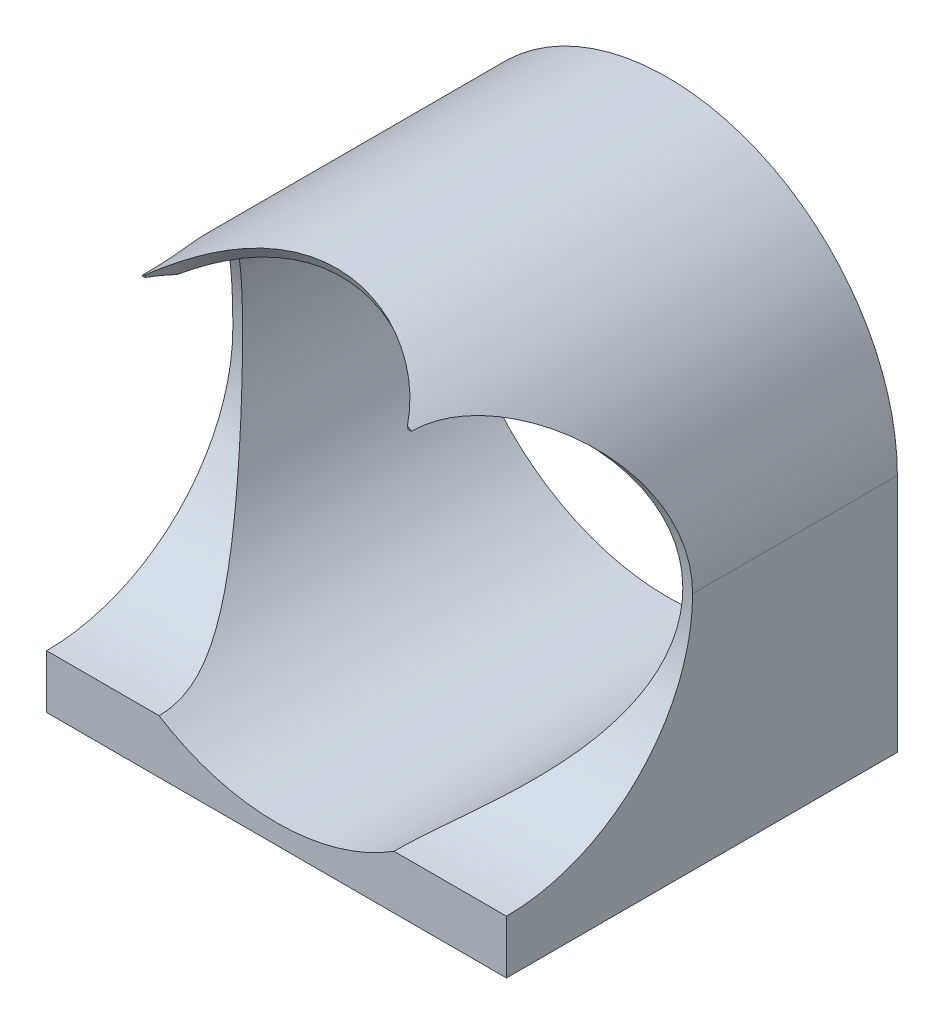
ISO-10303-21;
HEADER;
FILE_DESCRIPTION(('STEP AP214'),'2;1');
FILE_NAME('part.step','',(''),(''),'','','');
FILE_SCHEMA(('AUTOMOTIVE_DESIGN { 1 0 10303 214 1 1 1 1 }'));
ENDSEC;
DATA;
#1=APPLICATION_CONTEXT('core data for automotive mechanical design processes');
#2=APPLICATION_PROTOCOL_DEFINITION('international standard','automotive_design',2000,#1);
#3=PRODUCT_CONTEXT('',#1,'mechanical');
#4=PRODUCT('Part','Part','',(#3));
#5=PRODUCT_RELATED_PRODUCT_CATEGORY('part','',(#4));
#6=PRODUCT_DEFINITION_FORMATION('','',#4);
#7=PRODUCT_DEFINITION_CONTEXT('part definition',#1,'design');
#8=PRODUCT_DEFINITION('design','',#6,#7);
#9=PRODUCT_DEFINITION_SHAPE('','',#8);
#10=(LENGTH_UNIT() NAMED_UNIT(*) SI_UNIT(.MILLI.,.METRE.));
#11=(NAMED_UNIT(*) PLANE_ANGLE_UNIT() SI_UNIT($,.RADIAN.));
#12=(NAMED_UNIT(*) SI_UNIT($,.STERADIAN.) SOLID_ANGLE_UNIT());
#13=UNCERTAINTY_MEASURE_WITH_UNIT(LENGTH_MEASURE(1.E-05),#10,'distance_accuracy_value','');
#14=(GEOMETRIC_REPRESENTATION_CONTEXT(3) GLOBAL_UNCERTAINTY_ASSIGNED_CONTEXT((#13)) GLOBAL_UNIT_ASSIGNED_CONTEXT((#10,
#11,#12)) REPRESENTATION_CONTEXT('',''));
#15=CARTESIAN_POINT('',(0.,0.,0.));
#16=DIRECTION('',(0.,0.,1.));
#17=DIRECTION('',(1.,0.,0.));
#18=AXIS2_PLACEMENT_3D('',#15,#16,#17);
#19=CARTESIAN_POINT('',(0.,0.,0.));
#20=DIRECTION('',(0.,0.,1.));
#21=DIRECTION('',(1.,0.,0.));
#22=AXIS2_PLACEMENT_3D('',#19,#20,#21);
#23=PLANE('',#22);
#24=CARTESIAN_POINT('',(0.,-2.56739074444567E-13,0.));
#25=DIRECTION('',(0.,0.,1.));
#26=DIRECTION('',(0.,-1.,0.));
#27=AXIS2_PLACEMENT_3D('',#24,#25,#26);
#28=ELLIPSE('',#27,36.1565767183721,15.85);
#29=CARTESIAN_POINT('',(13.4715921210035,19.05,0.));
#30=VERTEX_POINT('',#29);
#31=CARTESIAN_POINT('',(13.3915454843399,19.3414615409709,0.));
#32=VERTEX_POINT('',#31);
#33=EDGE_CURVE('E120',#30,#32,#28,.T.);
#34=ORIENTED_EDGE('',*,*,#33,.F.);
#35=DIRECTION('',(1.,0.,0.));
#36=VECTOR('',#35,1.);
#37=CARTESIAN_POINT('',(-23.525,19.05,0.));
#38=LINE('',#37,#36);
#39=CARTESIAN_POINT('',(13.8030114467822,19.05,0.));
#40=VERTEX_POINT('',#39);
#41=EDGE_CURVE('E127',#40,#30,#38,.F.);
#42=ORIENTED_EDGE('',*,*,#41,.F.);
#43=CARTESIAN_POINT('',(0.,0.,0.));
#44=DIRECTION('',(0.,0.,1.));
#45=DIRECTION('',(1.,0.,0.));
#46=AXIS2_PLACEMENT_3D('',#43,#44,#45);
#47=CIRCLE('',#46,23.525);
#48=EDGE_CURVE('E129',#40,#32,#47,.T.);
#49=ORIENTED_EDGE('',*,*,#48,.T.);
#50=EDGE_LOOP('',(#34,#42,#49));
#51=FACE_BOUND('',#50,.T.);
#52=ADVANCED_FACE('F38',(#51),#23,.T.);
#53=DIRECTION('',(1.,0.,0.));
#54=VECTOR('',#53,1.);
#55=CARTESIAN_POINT('',(-23.525,-19.05,0.));
#56=LINE('',#55,#54);
#57=CARTESIAN_POINT('',(-23.525,-19.05,0.));
#58=VERTEX_POINT('',#57);
#59=CARTESIAN_POINT('',(-12.0196973755581,-19.05,0.));
#60=VERTEX_POINT('',#59);
#61=EDGE_CURVE('E143',#58,#60,#56,.T.);
#62=ORIENTED_EDGE('',*,*,#61,.F.);
#63=DIRECTION('',(0.,-1.,0.));
#64=VECTOR('',#63,1.);
#65=CARTESIAN_POINT('',(-23.525,0.,0.));
#66=LINE('',#65,#64);
#67=CARTESIAN_POINT('',(-23.525,-24.525,0.));
#68=VERTEX_POINT('',#67);
#69=EDGE_CURVE('E218',#58,#68,#66,.T.);
#70=ORIENTED_EDGE('',*,*,#69,.T.);
#71=DIRECTION('',(-1.,0.,0.));
#72=VECTOR('',#71,1.);
#73=CARTESIAN_POINT('',(0.,-24.525,0.));
#74=LINE('',#73,#72);
#75=CARTESIAN_POINT('',(23.525,-24.525,0.));
#76=VERTEX_POINT('',#75);
#77=EDGE_CURVE('E214',#76,#68,#74,.T.);
#78=ORIENTED_EDGE('',*,*,#77,.F.);
#79=DIRECTION('',(0.,1.,0.));
#80=VECTOR('',#79,1.);
#81=CARTESIAN_POINT('',(23.525,0.,0.));
#82=LINE('',#81,#80);
#83=CARTESIAN_POINT('',(23.525,-19.05,0.));
#84=VERTEX_POINT('',#83);
#85=EDGE_CURVE('E212',#76,#84,#82,.T.);
#86=ORIENTED_EDGE('',*,*,#85,.T.);
#87=CARTESIAN_POINT('',(12.0196973755581,-19.05,0.));
#88=VERTEX_POINT('',#87);
#89=EDGE_CURVE('E67',#88,#84,#56,.T.);
#90=ORIENTED_EDGE('',*,*,#89,.F.);
#91=CARTESIAN_POINT('',(0.,0.,0.));
#92=DIRECTION('',(0.,0.,1.));
#93=DIRECTION('',(1.,0.,0.));
#94=AXIS2_PLACEMENT_3D('',#91,#92,#93);
#95=CIRCLE('',#94,22.525);
#96=EDGE_CURVE('E230',#60,#88,#95,.T.);
#97=ORIENTED_EDGE('',*,*,#96,.F.);
#98=EDGE_LOOP('',(#62,#70,#78,#86,#90,#97));
#99=FACE_BOUND('',#98,.T.);
#100=ADVANCED_FACE('F262',(#99),#23,.T.);
#101=CARTESIAN_POINT('',(0.,0.,-40.));
#102=DIRECTION('',(0.,0.,1.));
#103=DIRECTION('',(1.,0.,0.));
#104=AXIS2_PLACEMENT_3D('',#101,#102,#103);
#105=CYLINDRICAL_SURFACE('',#104,23.525);
#106=CARTESIAN_POINT('',(13.3915454843399,19.3414615409709,0.));
#107=CARTESIAN_POINT('',(13.2741452215655,19.4227488667331,-0.166660695032087));
#108=CARTESIAN_POINT('',(13.1529120521341,19.5051033609422,-0.33004845359528));
#109=CARTESIAN_POINT('',(12.9030253770353,19.67130056655,-0.650219697078125));
#110=CARTESIAN_POINT('',(12.7743729310915,19.755143064233,-0.807004119669323));
#111=CARTESIAN_POINT('',(12.3778314275055,20.0078233890627,-1.26716948233464));
#112=CARTESIAN_POINT('',(12.0991546014151,20.1779566607628,-1.56065052760486));
#113=CARTESIAN_POINT('',(11.515768045907,20.5164892557352,-2.12031969014437));
#114=CARTESIAN_POINT('',(11.2110985192502,20.6848908210303,-2.3865486036965));
#115=CARTESIAN_POINT('',(10.5773645559341,21.0160129679722,-2.89227573073942));
#116=CARTESIAN_POINT('',(10.2482961414954,21.1787326169006,-3.13176956956217));
#117=CARTESIAN_POINT('',(9.56856001999574,21.4943820139895,-3.58351081944035));
#118=CARTESIAN_POINT('',(9.21793309313228,21.6473291937976,-3.79580746455374));
#119=CARTESIAN_POINT('',(8.49669425673176,21.9404498027971,-4.19357950022337));
#120=CARTESIAN_POINT('',(8.12608232388604,22.0806232170898,-4.37905485949679));
#121=CARTESIAN_POINT('',(7.36710561874806,22.345310958521,-4.72302398974049));
#122=CARTESIAN_POINT('',(6.97873883354625,22.469823504117,-4.88151469172559));
#123=CARTESIAN_POINT('',(6.18671859679126,22.7006672022082,-5.17123872972058));
#124=CARTESIAN_POINT('',(5.78306480741167,22.8069979526184,-5.30247146294249));
#125=CARTESIAN_POINT('',(4.95199123258167,23.0019662382463,-5.54055919118524));
#126=CARTESIAN_POINT('',(4.52422394287642,23.0900475085813,-5.64665893177224));
#127=CARTESIAN_POINT('',(3.65836240062984,23.2429621144849,-5.82946793433219));
#128=CARTESIAN_POINT('',(3.22026795998736,23.3077950262533,-5.90617666053056));
#129=CARTESIAN_POINT('',(2.33701040273976,23.4128551963083,-6.02992232800186));
#130=CARTESIAN_POINT('',(1.89184764354196,23.4530836946701,-6.07696076467639));
#131=CARTESIAN_POINT('',(0.997817026609435,23.508095358831,-6.1411812655202));
#132=CARTESIAN_POINT('',(0.548949280828574,23.5228792906826,-6.15836422854016));
#133=CARTESIAN_POINT('',(-0.335337255626572,23.5266377724987,-6.16273704291516));
#134=CARTESIAN_POINT('',(-0.770748762106412,23.5163856094176,-6.15082552954681));
#135=CARTESIAN_POINT('',(-1.63865333593245,23.4718818786517,-6.09892373783703));
#136=CARTESIAN_POINT('',(-2.07114646423189,23.4376308137841,-6.05893404778038));
#137=CARTESIAN_POINT('',(-2.93007213570488,23.3458097664723,-5.95103598118804));
#138=CARTESIAN_POINT('',(-3.35650539962886,23.2882425816485,-5.8831309541021));
#139=CARTESIAN_POINT('',(-4.20039520760996,23.1509192670805,-5.71963837738186));
#140=CARTESIAN_POINT('',(-4.61785164092144,23.0711628637607,-5.62405048643902));
#141=CARTESIAN_POINT('',(-5.4397616161067,22.8912883007565,-5.40579942141535));
#142=CARTESIAN_POINT('',(-5.84424960662435,22.7912303555177,-5.28321622577943));
#143=CARTESIAN_POINT('',(-6.63887696615571,22.5725663436982,-5.0111122889143));
#144=CARTESIAN_POINT('',(-7.02901664637207,22.4539606796951,-4.86159213234027));
#145=CARTESIAN_POINT('',(-7.79259441119966,22.2005166508095,-4.53584619804188));
#146=CARTESIAN_POINT('',(-8.16602968112483,22.0656755642907,-4.35961594146648));
#147=CARTESIAN_POINT('',(-8.89388957122447,21.7824903621239,-3.98065390981754));
#148=CARTESIAN_POINT('',(-9.24831214057979,21.6341447944408,-3.77791928390454));
#149=CARTESIAN_POINT('',(-9.9654839560701,21.3138885763921,-3.32753239092232));
#150=CARTESIAN_POINT('',(-10.3263405866171,21.1410480336313,-3.07751905267109));
#151=CARTESIAN_POINT('',(-11.0203631501904,20.7877098726907,-2.54649978062544));
#152=CARTESIAN_POINT('',(-11.3535319294921,20.6072130444557,-2.26549703942956));
#153=CARTESIAN_POINT('',(-11.9903214310618,20.2433317558456,-1.67183424337696));
#154=CARTESIAN_POINT('',(-12.2938806901742,20.0599421698829,-1.3591109758592));
#155=CARTESIAN_POINT('',(-12.7244530513414,19.7874427482518,-0.866880414325132));
#156=CARTESIAN_POINT('',(-12.8639087151717,19.6969988251643,-0.698862119284823));
#157=CARTESIAN_POINT('',(-13.1342400520556,19.5177785002389,-0.355162997237562));
#158=CARTESIAN_POINT('',(-13.2651144570878,19.4290023462178,-0.179481044158269));
#159=CARTESIAN_POINT('',(-13.3915454843399,19.3414615409709,0.));
#160=B_SPLINE_CURVE_WITH_KNOTS('',3,(#106,#107,#108,#109,#110,#111,#112,#113,#114,#115,#116,
#117,#118,#119,#120,#121,#122,#123,#124,#125,#126,#127,#128,#129,#130,#131,#132,#133,#134,#135,
#136,#137,#138,#139,#140,#141,#142,#143,#144,#145,#146,#147,#148,#149,#150,#151,#152,#153,#154,
#155,#156,#157,#158,#159),.UNSPECIFIED.,.F.,.F.,(4,2,2,2,2,2,2,2,2,2,2,2,2,2,2,2,2,2,2,2,2,2,2,
2,2,2,4),(0.,0.658271137693634,1.31644848376142,2.63166604207735,3.94488501316637,
5.25831855265161,6.56933978503903,7.8803625465138,9.19153431212952,10.5027350701641,
11.8493960313276,13.196081539871,14.5426991691773,15.8892762555269,17.1947906577275,
18.5002777080332,19.8056081638616,21.1109547141014,22.4124847587567,23.7139865576629,
25.0157068392838,26.3175672507608,27.7310755142233,29.1444382906572,30.5606751168787,
31.2694554613954,31.9783403048649),.UNSPECIFIED.);
#161=CARTESIAN_POINT('',(-13.3915454843399,19.3414615409709,0.));
#162=VERTEX_POINT('',#161);
#163=EDGE_CURVE('E130',#32,#162,#160,.T.);
#164=ORIENTED_EDGE('',*,*,#163,.F.);
#165=ORIENTED_EDGE('',*,*,#48,.F.);
#166=CARTESIAN_POINT('',(23.525,0.,-19.05));
#167=CARTESIAN_POINT('',(23.5250033520215,0.229250982778095,-19.0500026657862));
#168=CARTESIAN_POINT('',(23.521647888478,0.458467980801515,-19.0458606391294));
#169=CARTESIAN_POINT('',(23.5082600573139,0.916398780670761,-19.0293247365023));
#170=CARTESIAN_POINT('',(23.4982279889799,1.1451126046109,-19.0169312304141));
#171=CARTESIAN_POINT('',(23.4582024510975,1.82945091805857,-18.9674600612974));
#172=CARTESIAN_POINT('',(23.4182794917402,2.28370214279328,-18.9180915985082));
#173=CARTESIAN_POINT('',(23.3132776055044,3.181101668599,-18.787954720247));
#174=CARTESIAN_POINT('',(23.2483897624036,3.62430771798389,-18.7074247914933));
#175=CARTESIAN_POINT('',(23.0948686388644,4.50003230216295,-18.5162921003429));
#176=CARTESIAN_POINT('',(23.0062324051922,4.93254950043252,-18.405685597745));
#177=CARTESIAN_POINT('',(22.8072958226156,5.78300612227511,-18.1564104681446));
#178=CARTESIAN_POINT('',(22.6970509421574,6.20097971003053,-18.0178136639338));
#179=CARTESIAN_POINT('',(22.4568318420785,7.02132604601023,-17.7142535935372));
#180=CARTESIAN_POINT('',(22.3268582208835,7.42369926697098,-17.5492911270849));
#181=CARTESIAN_POINT('',(22.0491681937108,8.21186212835673,-17.194617985097));
#182=CARTESIAN_POINT('',(21.9014232890654,8.59762374776764,-17.0048675155508));
#183=CARTESIAN_POINT('',(21.5906301916219,9.35074063636541,-16.6026646158456));
#184=CARTESIAN_POINT('',(21.4275788194289,9.71809205704925,-16.3902074678761));
#185=CARTESIAN_POINT('',(21.0285772603912,10.5598957171133,-15.8655726013684));
#186=CARTESIAN_POINT('',(20.7872132042309,11.0263729636375,-15.5446696709075));
#187=CARTESIAN_POINT('',(20.2862571885405,11.9229740859044,-14.8681149784918));
#188=CARTESIAN_POINT('',(20.0266593079783,12.353086051974,-14.5124519141376));
#189=CARTESIAN_POINT('',(19.4942153876177,13.1773460725342,-13.7684079983742));
#190=CARTESIAN_POINT('',(19.2213389568873,13.5714050489492,-13.3799504387011));
#191=CARTESIAN_POINT('',(18.6686953094022,14.3221032158982,-12.5731263860649));
#192=CARTESIAN_POINT('',(18.3889289146277,14.6787468436777,-12.1547634496247));
#193=CARTESIAN_POINT('',(17.8240155506085,15.3599815410669,-11.2820639920297));
#194=CARTESIAN_POINT('',(17.5388557477509,15.6839491656573,-10.827249081978));
#195=CARTESIAN_POINT('',(16.9750308380597,16.2925130036937,-9.88786296710637));
#196=CARTESIAN_POINT('',(16.6963678809222,16.5770963350726,-9.40328210072452));
#197=CARTESIAN_POINT('',(16.1553136978836,17.1047907636841,-8.40515642668867));
#198=CARTESIAN_POINT('',(15.8928848193585,17.3480003072267,-7.89168435458604));
#199=CARTESIAN_POINT('',(15.3951140220245,17.7912032809822,-6.83402010586856));
#200=CARTESIAN_POINT('',(15.1597485129086,17.9912344839423,-6.28985530951633));
#201=CARTESIAN_POINT('',(14.8201140742538,18.2706393842127,-5.40400489686678));
#202=CARTESIAN_POINT('',(14.7020880505921,18.3655562791037,-5.0724430389162));
#203=CARTESIAN_POINT('',(14.483585677642,18.5383588117199,-4.39914874756417));
#204=CARTESIAN_POINT('',(14.3831092354138,18.6162445396401,-4.05741636803537));
#205=CARTESIAN_POINT('',(14.2036138603716,18.7535529238252,-3.3660760338927));
#206=CARTESIAN_POINT('',(14.1245165066998,18.8130431757114,-3.01650210009312));
#207=CARTESIAN_POINT('',(13.9907019128729,18.9127701801447,-2.31012974198465));
#208=CARTESIAN_POINT('',(13.9359700037824,18.9530185181464,-1.95333580004588));
#209=CARTESIAN_POINT('',(13.8645112722192,19.0053256531918,-1.33045696104864));
#210=CARTESIAN_POINT('',(13.8415500555605,19.0220332664164,-1.06546265651189));
#211=CARTESIAN_POINT('',(13.810750300128,19.0443926767001,-0.53366741639773));
#212=CARTESIAN_POINT('',(13.8029385362667,19.050024899528,-0.266864116954171));
#213=CARTESIAN_POINT('',(13.8030114467822,19.05,0.));
#214=B_SPLINE_CURVE_WITH_KNOTS('',3,(#166,#167,#168,#169,#170,#171,#172,#173,#174,#175,#176,
#177,#178,#179,#180,#181,#182,#183,#184,#185,#186,#187,#188,#189,#190,#191,#192,#193,#194,#195,
#196,#197,#198,#199,#200,#201,#202,#203,#204,#205,#206,#207,#208,#209,#210,#211,#212,#213),
.UNSPECIFIED.,.F.,.F.,(4,2,2,2,2,2,2,2,2,2,2,2,2,2,2,2,2,2,2,2,2,2,2,4),(0.,0.68762386512987,
1.37521690880139,2.74911831499137,4.11270647976197,5.47646429245439,6.83676619291334,
8.19702684000104,9.5594986845272,10.9222541648133,12.7661186128175,14.61058460824,
16.4594912527898,18.3081783791642,20.1872625501965,22.0669598987816,23.9421200931601,
25.8156331744179,26.9083887158689,28.0011384700874,29.0898237568503,30.1778527238472,
30.9767529475938,31.7770638532536),.UNSPECIFIED.);
#215=CARTESIAN_POINT('',(23.525,0.,-19.05));
#216=VERTEX_POINT('',#215);
#217=EDGE_CURVE('E135',#216,#40,#214,.T.);
#218=ORIENTED_EDGE('',*,*,#217,.F.);
#219=DIRECTION('',(0.,0.,-1.));
#220=VECTOR('',#219,1.);
#221=CARTESIAN_POINT('',(23.525,0.,0.));
#222=LINE('',#221,#220);
#223=CARTESIAN_POINT('',(23.525,0.,-40.));
#224=VERTEX_POINT('',#223);
#225=EDGE_CURVE('E228',#216,#224,#222,.T.);
#226=ORIENTED_EDGE('',*,*,#225,.T.);
#227=CARTESIAN_POINT('',(0.,0.,-40.));
#228=DIRECTION('',(0.,0.,1.));
#229=DIRECTION('',(1.,0.,0.));
#230=AXIS2_PLACEMENT_3D('',#227,#228,#229);
#231=CIRCLE('',#230,23.525);
#232=CARTESIAN_POINT('',(-23.525,0.,-40.));
#233=VERTEX_POINT('',#232);
#234=EDGE_CURVE('E242',#224,#233,#231,.T.);
#235=ORIENTED_EDGE('',*,*,#234,.T.);
#236=DIRECTION('',(0.,0.,-1.));
#237=VECTOR('',#236,1.);
#238=CARTESIAN_POINT('',(-23.525,0.,0.));
#239=LINE('',#238,#237);
#240=CARTESIAN_POINT('',(-23.525,0.,-19.05));
#241=VERTEX_POINT('',#240);
#242=EDGE_CURVE('E231',#241,#233,#239,.T.);
#243=ORIENTED_EDGE('',*,*,#242,.F.);
#244=CARTESIAN_POINT('',(-13.8030114467822,19.05,0.));
#245=CARTESIAN_POINT('',(-13.8030009164838,19.0500030431344,-0.17772516167336));
#246=CARTESIAN_POINT('',(-13.8064456741249,19.0475121689748,-0.355422462999331));
#247=CARTESIAN_POINT('',(-13.8201441336146,19.0375772444468,-0.710393832650147));
#248=CARTESIAN_POINT('',(-13.8303969736725,19.0301338209893,-0.887667951692863));
#249=CARTESIAN_POINT('',(-13.8711627948777,19.0004648608355,-1.41767323996915));
#250=CARTESIAN_POINT('',(-13.9116838869015,18.9709003368143,-1.76929191529199));
#251=CARTESIAN_POINT('',(-14.0166979555507,18.8934363179562,-2.46178710391976));
#252=CARTESIAN_POINT('',(-14.0808557119146,18.845792950579,-2.80274475384355));
#253=CARTESIAN_POINT('',(-14.2304411921917,18.7330969690212,-3.4771463655501));
#254=CARTESIAN_POINT('',(-14.3158797768697,18.6680354641446,-3.81058639563155));
#255=CARTESIAN_POINT('',(-14.5396920867018,18.4945852777622,-4.58971179875839));
#256=CARTESIAN_POINT('',(-14.6859748953602,18.3790633656099,-5.03153946838701));
#257=CARTESIAN_POINT('',(-15.0045666297817,18.1198988670817,-5.89712724390482));
#258=CARTESIAN_POINT('',(-15.1768850185137,17.97624605052,-6.32088070838567));
#259=CARTESIAN_POINT('',(-15.5418321190508,17.6616960916458,-7.1530604363681));
#260=CARTESIAN_POINT('',(-15.7345980992517,17.4906102836704,-7.56135441623864));
#261=CARTESIAN_POINT('',(-16.1334298077935,17.1234229591089,-8.35966008254371));
#262=CARTESIAN_POINT('',(-16.3394954586228,16.9273215883094,-8.74967187550571));
#263=CARTESIAN_POINT('',(-16.8402495976525,16.4316296985457,-9.65733494040459));
#264=CARTESIAN_POINT('',(-17.1387615082886,16.1210956961355,-10.1669300352166));
#265=CARTESIAN_POINT('',(-17.7413694060516,15.4554615512411,-11.1528033683583));
#266=CARTESIAN_POINT('',(-18.0454674316881,15.1003448521041,-11.6290691263204));
#267=CARTESIAN_POINT('',(-18.6500368364565,14.3469379969127,-12.546694240942));
#268=CARTESIAN_POINT('',(-18.950514136758,13.9487334806344,-12.9881199291425));
#269=CARTESIAN_POINT('',(-19.5408321020844,13.1089597835042,-13.8352138558804));
#270=CARTESIAN_POINT('',(-19.8306764325636,12.6674057430114,-14.2408944855523));
#271=CARTESIAN_POINT('',(-20.3360414395174,11.8346175936934,-14.9357339506463));
#272=CARTESIAN_POINT('',(-20.5547720047433,11.4511660836308,-15.2319025970667));
#273=CARTESIAN_POINT('',(-20.977375863096,10.657275595647,-15.7975480347801));
#274=CARTESIAN_POINT('',(-21.1812496773033,10.2468375652034,-16.0670257623407));
#275=CARTESIAN_POINT('',(-21.5703590913062,9.40010744042481,-16.5766191374352));
#276=CARTESIAN_POINT('',(-21.7556103436257,8.96383755666564,-16.8167594806304));
#277=CARTESIAN_POINT('',(-22.016819706581,8.29115095271161,-17.15290572508));
#278=CARTESIAN_POINT('',(-22.1011083812924,8.06388506165334,-17.2609397248924));
#279=CARTESIAN_POINT('',(-22.2637267739399,7.60340256742047,-17.4686744156719));
#280=CARTESIAN_POINT('',(-22.3420549189149,7.37018441500089,-17.5683729076107));
#281=CARTESIAN_POINT('',(-22.5426558450952,6.73983869836603,-17.8229583132895));
#282=CARTESIAN_POINT('',(-22.6591784331324,6.33766041861341,-17.970026215429));
#283=CARTESIAN_POINT('',(-22.8722204617236,5.51958271301559,-18.2379257471267));
#284=CARTESIAN_POINT('',(-22.9687436070429,5.10368584502497,-18.35876223608));
#285=CARTESIAN_POINT('',(-23.1398715390219,4.26104105464191,-18.572415523159));
#286=CARTESIAN_POINT('',(-23.2145111864836,3.83431158035302,-18.6652768927151));
#287=CARTESIAN_POINT('',(-23.340536727834,2.9723038607621,-18.8217873602589));
#288=CARTESIAN_POINT('',(-23.3919334124864,2.53702968055733,-18.8854500142196));
#289=CARTESIAN_POINT('',(-23.4623095251104,1.75140555983455,-18.9725426418497));
#290=CARTESIAN_POINT('',(-23.4857896126598,1.40206431654939,-19.0015636610096));
#291=CARTESIAN_POINT('',(-23.5171478281749,0.701830042228784,-19.0403031200643));
#292=CARTESIAN_POINT('',(-23.5250353320731,0.350938070966992,-19.0500331597739));
#293=CARTESIAN_POINT('',(-23.525,0.,-19.05));
#294=B_SPLINE_CURVE_WITH_KNOTS('',3,(#244,#245,#246,#247,#248,#249,#250,#251,#252,#253,#254,
#255,#256,#257,#258,#259,#260,#261,#262,#263,#264,#265,#266,#267,#268,#269,#270,#271,#272,#273,
#274,#275,#276,#277,#278,#279,#280,#281,#282,#283,#284,#285,#286,#287,#288,#289,#290,#291,#292,
#293),.UNSPECIFIED.,.F.,.F.,(4,2,2,2,2,2,2,2,2,2,2,2,2,2,2,2,2,2,2,2,2,2,2,2,4),(0.,
0.53307073623192,1.06607400737548,2.12997539470944,3.17933526646556,4.22923178494017,
5.66555491689018,7.10240136055679,8.54959044360769,9.99677109306504,11.995944221138,
13.9958619895332,15.9918753760243,17.9871940935241,19.5805502617233,21.1738505181569,
22.7658001851464,23.5617080914008,24.3578253115329,25.6877530452673,27.0174341979395,
28.344985490074,29.6719198197325,30.7250594768923,31.7775656807561),.UNSPECIFIED.);
#295=CARTESIAN_POINT('',(-13.8030114467822,19.05,0.));
#296=VERTEX_POINT('',#295);
#297=EDGE_CURVE('E149',#296,#241,#294,.T.);
#298=ORIENTED_EDGE('',*,*,#297,.F.);
#299=EDGE_CURVE('E239',#162,#296,#47,.T.);
#300=ORIENTED_EDGE('',*,*,#299,.F.);
#301=EDGE_LOOP('',(#164,#165,#218,#226,#235,#243,#298,#300));
#302=FACE_BOUND('',#301,.T.);
#303=ADVANCED_FACE('F40',(#302),#105,.T.);
#304=CARTESIAN_POINT('',(0.,0.,-40.));
#305=DIRECTION('',(0.,0.,1.));
#306=DIRECTION('',(1.,0.,0.));
#307=AXIS2_PLACEMENT_3D('',#304,#305,#306);
#308=PLANE('',#307);
#309=CARTESIAN_POINT('',(0.,0.,-40.));
#310=DIRECTION('',(0.,0.,1.));
#311=DIRECTION('',(1.,0.,0.));
#312=AXIS2_PLACEMENT_3D('',#309,#310,#311);
#313=CIRCLE('',#312,22.525);
#314=CARTESIAN_POINT('',(22.525,0.,-40.));
#315=VERTEX_POINT('',#314);
#316=EDGE_CURVE('E236',#315,#315,#313,.T.);
#317=ORIENTED_EDGE('',*,*,#316,.T.);
#318=EDGE_LOOP('',(#317));
#319=FACE_BOUND('',#318,.T.);
#320=ORIENTED_EDGE('',*,*,#234,.F.);
#321=DIRECTION('',(0.,1.,0.));
#322=VECTOR('',#321,1.);
#323=CARTESIAN_POINT('',(23.525,0.,-40.));
#324=LINE('',#323,#322);
#325=CARTESIAN_POINT('',(23.525,-24.525,-40.));
#326=VERTEX_POINT('',#325);
#327=EDGE_CURVE('E154',#326,#224,#324,.T.);
#328=ORIENTED_EDGE('',*,*,#327,.F.);
#329=DIRECTION('',(-1.,0.,0.));
#330=VECTOR('',#329,1.);
#331=CARTESIAN_POINT('',(0.,-24.525,-40.));
#332=LINE('',#331,#330);
#333=CARTESIAN_POINT('',(-23.525,-24.525,-40.));
#334=VERTEX_POINT('',#333);
#335=EDGE_CURVE('E223',#326,#334,#332,.T.);
#336=ORIENTED_EDGE('',*,*,#335,.T.);
#337=DIRECTION('',(0.,-1.,0.));
#338=VECTOR('',#337,1.);
#339=CARTESIAN_POINT('',(-23.525,0.,-40.));
#340=LINE('',#339,#338);
#341=EDGE_CURVE('E215',#233,#334,#340,.T.);
#342=ORIENTED_EDGE('',*,*,#341,.F.);
#343=EDGE_LOOP('',(#320,#328,#336,#342));
#344=FACE_BOUND('',#343,.T.);
#345=ADVANCED_FACE('F196',(#319,#344),#308,.F.);
#346=CARTESIAN_POINT('',(-13.4715921210035,19.05,0.));
#347=VERTEX_POINT('',#346);
#348=EDGE_CURVE('E132',#162,#347,#28,.T.);
#349=ORIENTED_EDGE('',*,*,#348,.F.);
#350=ORIENTED_EDGE('',*,*,#299,.T.);
#351=EDGE_CURVE('E139',#347,#296,#38,.F.);
#352=ORIENTED_EDGE('',*,*,#351,.F.);
#353=EDGE_LOOP('',(#349,#350,#352));
#354=FACE_BOUND('',#353,.T.);
#355=ADVANCED_FACE('F193',(#354),#23,.T.);
#356=CARTESIAN_POINT('',(0.,0.,-40.));
#357=DIRECTION('',(0.,0.,1.));
#358=DIRECTION('',(1.,0.,0.));
#359=AXIS2_PLACEMENT_3D('',#356,#357,#358);
#360=CYLINDRICAL_SURFACE('',#359,22.525);
#361=ORIENTED_EDGE('',*,*,#316,.F.);
#362=EDGE_LOOP('',(#361));
#363=FACE_BOUND('',#362,.T.);
#364=CARTESIAN_POINT('',(12.0196973755581,-19.05,0.));
#365=CARTESIAN_POINT('',(12.0196858114733,-19.0500030714084,-0.165926796876453));
#366=CARTESIAN_POINT('',(12.0231349812081,-19.0478314724119,-0.331826106749044));
#367=CARTESIAN_POINT('',(12.0368440007822,-19.0391730228799,-0.663205843129461));
#368=CARTESIAN_POINT('',(12.0471028197864,-19.0326868254818,-0.828686329232877));
#369=CARTESIAN_POINT('',(12.0878680052095,-19.0068452594453,-1.32328664654144));
#370=CARTESIAN_POINT('',(12.1283641072549,-18.9811065839177,-1.6513145125644));
#371=CARTESIAN_POINT('',(12.2330528729968,-18.9137989527337,-2.29661605789477));
#372=CARTESIAN_POINT('',(12.2968755903301,-18.8724768321777,-2.61397742582234));
#373=CARTESIAN_POINT('',(12.4453908991284,-18.7748703379778,-3.24155424215527));
#374=CARTESIAN_POINT('',(12.5300955865238,-18.7185772908952,-3.55176543451528));
#375=CARTESIAN_POINT('',(12.7557671621388,-18.5658668539448,-4.29022884445578));
#376=CARTESIAN_POINT('',(12.9055256202117,-18.4624784371314,-4.71435264704579));
#377=CARTESIAN_POINT('',(13.2315514922172,-18.2302415491936,-5.54499919313113));
#378=CARTESIAN_POINT('',(13.4078301360309,-18.1013822852369,-5.9515143859517));
#379=CARTESIAN_POINT('',(13.7810171790071,-17.8189334869646,-6.75049045285482));
#380=CARTESIAN_POINT('',(13.9780847574663,-17.6651474458046,-7.14280655824587));
#381=CARTESIAN_POINT('',(14.3855283819252,-17.3349661209752,-7.91050039791693));
#382=CARTESIAN_POINT('',(14.5959040297911,-17.1585715135181,-8.28587863834726));
#383=CARTESIAN_POINT('',(15.1281505435671,-16.6940732564751,-9.1969064575081));
#384=CARTESIAN_POINT('',(15.4550787678115,-16.3929840851167,-9.72302170008184));
#385=CARTESIAN_POINT('',(16.1154185322142,-15.744318237667,-10.7416747150534));
#386=CARTESIAN_POINT('',(16.4488329455254,-15.3967205398774,-11.2341971507334));
#387=CARTESIAN_POINT('',(17.1118761220256,-14.6562544858272,-12.1843573391329));
#388=CARTESIAN_POINT('',(17.441511840382,-14.2634923394657,-12.6420728941679));
#389=CARTESIAN_POINT('',(18.0895891176821,-13.432055403136,-13.5221514473325));
#390=CARTESIAN_POINT('',(18.408035083474,-12.9933989646351,-13.9445284554013));
#391=CARTESIAN_POINT('',(18.959075488763,-12.1703858233658,-14.6633673562981));
#392=CARTESIAN_POINT('',(19.1952957947806,-11.7949243461115,-14.9672540740957));
#393=CARTESIAN_POINT('',(19.6526684791213,-11.0159978574211,-15.5494926107053));
#394=CARTESIAN_POINT('',(19.8738213836558,-10.6125338249359,-15.8278453213803));
#395=CARTESIAN_POINT('',(20.2971327273306,-9.77856585899842,-16.3562043655681));
#396=CARTESIAN_POINT('',(20.499311617968,-9.34809189390023,-16.6062412813275));
#397=CARTESIAN_POINT('',(20.7855857881195,-8.68293482173811,-16.9579499966485));
#398=CARTESIAN_POINT('',(20.8781752690976,-8.45798281794992,-17.071291641683));
#399=CARTESIAN_POINT('',(21.0572634051877,-8.00170986443089,-17.2898567210586));
#400=CARTESIAN_POINT('',(21.1437604692754,-7.77038727280915,-17.3950780354706));
#401=CARTESIAN_POINT('',(21.3638494514298,-7.15044649354345,-17.662100591292));
#402=CARTESIAN_POINT('',(21.4918223304503,-6.75663112096715,-17.8166085713429));
#403=CARTESIAN_POINT('',(21.7277803748289,-5.95432643553576,-18.1005399513702));
#404=CARTESIAN_POINT('',(21.8357694221091,-5.54583999103046,-18.2299682233896));
#405=CARTESIAN_POINT('',(22.0298198242061,-4.71635179058769,-18.4619575913256));
#406=CARTESIAN_POINT('',(22.1158897113179,-4.29535497594293,-18.5645291419808));
#407=CARTESIAN_POINT('',(22.2644595865729,-3.44332037564874,-18.7412734067209));
#408=CARTESIAN_POINT('',(22.3269593070876,-3.0122824760463,-18.8154457983462));
#409=CARTESIAN_POINT('',(22.427295756557,-2.14127526995312,-18.9343998482814));
#410=CARTESIAN_POINT('',(22.4650186307176,-1.70127418085941,-18.9790458329602));
#411=CARTESIAN_POINT('',(22.5144982691229,-0.817765210854865,-19.0375879020645));
#412=CARTESIAN_POINT('',(22.5262549782771,-0.374257322505894,-19.0514839212499));
#413=CARTESIAN_POINT('',(22.5235327876124,0.512540540258166,-19.0482651297826));
#414=CARTESIAN_POINT('',(22.5090551783884,0.955830524319928,-19.0311518446297));
#415=CARTESIAN_POINT('',(22.454197665197,1.83851979817323,-18.9662376219653));
#416=CARTESIAN_POINT('',(22.4138187755751,2.277919239643,-18.918437886196));
#417=CARTESIAN_POINT('',(22.3118975192199,3.11780130969256,-18.7975693961491));
#418=CARTESIAN_POINT('',(22.2520981437262,3.51879911282428,-18.7265795998165));
#419=CARTESIAN_POINT('',(22.1120922735657,4.31198045366586,-18.5599982986938));
#420=CARTESIAN_POINT('',(22.0318869907924,4.70416451331331,-18.4644082548923));
#421=CARTESIAN_POINT('',(21.8524327734728,5.47763193130259,-18.2499080425089));
#422=CARTESIAN_POINT('',(21.7531829879991,5.85891480169341,-18.1309968319086));
#423=CARTESIAN_POINT('',(21.5372001460711,6.60885276549689,-17.8712915938897));
#424=CARTESIAN_POINT('',(21.4204659989191,6.97750706935876,-17.7304962012859));
#425=CARTESIAN_POINT('',(21.1611075793534,7.7300776093194,-17.4163095822503));
#426=CARTESIAN_POINT('',(21.0171532108019,8.11281837218928,-17.2412034096133));
#427=CARTESIAN_POINT('',(20.712954958603,8.86070725368001,-16.8690505887139));
#428=CARTESIAN_POINT('',(20.5527106318919,9.22585489339454,-16.6720033436716));
#429=CARTESIAN_POINT('',(20.2180123408914,9.93792992039705,-16.2576087352784));
#430=CARTESIAN_POINT('',(20.0435505030528,10.2848470344376,-16.0402501137352));
#431=CARTESIAN_POINT('',(19.6826196472896,10.9597735837751,-15.5868916288757));
#432=CARTESIAN_POINT('',(19.4961482400719,11.2877792318994,-15.3508880540325));
#433=CARTESIAN_POINT('',(19.0192467511501,12.0810045636098,-14.7414507347185));
#434=CARTESIAN_POINT('',(18.7227343031965,12.5345049247601,-14.3574426549459));
#435=CARTESIAN_POINT('',(18.1144246527754,13.3986055749892,-13.5546296442013));
#436=CARTESIAN_POINT('',(17.8026204627978,13.8091859784822,-13.1358087437314));
#437=CARTESIAN_POINT('',(17.1701405555876,14.5881464212106,-12.2650084465209));
#438=CARTESIAN_POINT('',(16.849449060542,14.9564445269171,-11.812967365379));
#439=CARTESIAN_POINT('',(16.2073970382262,15.6498853111531,-10.8776160075191));
#440=CARTESIAN_POINT('',(15.8860367696235,15.9750423350873,-10.3943162049644));
#441=CARTESIAN_POINT('',(15.3277154961518,16.509033553705,-9.51584487696818));
#442=CARTESIAN_POINT('',(15.0890020777823,16.7270601318144,-9.12734633629508));
#443=CARTESIAN_POINT('',(14.6212044178365,17.1374659983698,-8.33128677164554));
#444=CARTESIAN_POINT('',(14.3921212527354,17.3298424248194,-7.92372362731784));
#445=CARTESIAN_POINT('',(13.9502702055067,17.6874582544156,-7.08955895592967));
#446=CARTESIAN_POINT('',(13.7374678225019,17.8527559402356,-6.66300089969324));
#447=CARTESIAN_POINT('',(13.335565320759,18.1549290263239,-5.78917254960902));
#448=CARTESIAN_POINT('',(13.1464514437846,18.2918209552201,-5.34191448696138));
#449=CARTESIAN_POINT('',(12.8613632305366,18.4927039213216,-4.5845904468549));
#450=CARTESIAN_POINT('',(12.7557764204162,18.5655456293291,-4.28048032017212));
#451=CARTESIAN_POINT('',(12.5622203402025,18.6970568030393,-3.66360301050317));
#452=CARTESIAN_POINT('',(12.4742516766061,18.7557257808666,-3.35083552991322));
#453=CARTESIAN_POINT('',(12.3195417721754,18.8577067438389,-2.71873570498639));
#454=CARTESIAN_POINT('',(12.2527295139882,18.9010701637826,-2.39942923824359));
#455=CARTESIAN_POINT('',(12.1430192403544,18.9717425472634,-1.75509330257219));
#456=CARTESIAN_POINT('',(12.1001048524543,18.9990625028945,-1.43006790955756));
#457=CARTESIAN_POINT('',(12.0534955135376,19.028642707911,-0.920299880305002));
#458=CARTESIAN_POINT('',(12.040853232562,19.0366393882543,-0.736659977725086));
#459=CARTESIAN_POINT('',(12.0239405722859,19.0473231029359,-0.368691126896616));
#460=CARTESIAN_POINT('',(12.019677074448,19.0500057729121,-0.184361736740399));
#461=CARTESIAN_POINT('',(12.0196973755582,19.05,0.));
#462=B_SPLINE_CURVE_WITH_KNOTS('',3,(#364,#365,#366,#367,#368,#369,#370,#371,#372,#373,#374,
#375,#376,#377,#378,#379,#380,#381,#382,#383,#384,#385,#386,#387,#388,#389,#390,#391,#392,#393,
#394,#395,#396,#397,#398,#399,#400,#401,#402,#403,#404,#405,#406,#407,#408,#409,#410,#411,#412,
#413,#414,#415,#416,#417,#418,#419,#420,#421,#422,#423,#424,#425,#426,#427,#428,#429,#430,#431,
#432,#433,#434,#435,#436,#437,#438,#439,#440,#441,#442,#443,#444,#445,#446,#447,#448,#449,#450,
#451,#452,#453,#454,#455,#456,#457,#458,#459,#460,#461),.UNSPECIFIED.,.F.,.F.,(4,2,2,2,2,2,2,2,
2,2,2,2,2,2,2,2,2,2,2,2,2,2,2,2,2,2,2,2,2,2,2,2,2,2,2,2,2,2,2,2,2,2,2,2,2,2,2,2,4),(0.,
0.497677391071328,0.995279461613588,1.98824565521202,2.96610273364479,3.9445275745202,
5.32680771959661,6.70967484253241,8.10402727454395,9.49833801181001,11.5617606074334,
13.6261190338508,15.6857184871182,17.744497506026,19.3561831325241,20.967812443911,
22.577684184257,23.3825648983736,24.1876550323206,25.5121566022331,26.8364006128436,
28.1601283550054,29.4838711270492,30.8136549903055,32.1434416748696,33.4731629424814,
34.8028321387506,36.0362776396117,37.2696499040462,38.5030772896229,39.7365816501059,
41.0698039781286,42.403062577612,43.7370646095201,45.0713328647157,47.0608385605911,
49.0512619823145,51.0454795177952,53.0390322590567,54.5543305414586,56.0697977568042,
57.5819590515737,59.0932379732566,60.0826655562534,61.0721271939951,62.0582313273828,
63.0436590461324,63.5961606351333,64.1491158022643),.UNSPECIFIED.);
#463=CARTESIAN_POINT('',(12.1903263880311,18.9412662605558,-2.03246954386246));
#464=VERTEX_POINT('',#463);
#465=EDGE_CURVE('E137',#88,#464,#462,.T.);
#466=ORIENTED_EDGE('',*,*,#465,.T.);
#467=CARTESIAN_POINT('',(13.7944918789603,17.8069542258438,0.));
#468=CARTESIAN_POINT('',(13.6870793934245,17.890165843935,-0.170606893186759));
#469=CARTESIAN_POINT('',(13.5757664513028,17.9748381433095,-0.337990332920456));
#470=CARTESIAN_POINT('',(13.3455820816966,18.1463951297717,-0.666252844800521));
#471=CARTESIAN_POINT('',(13.2267119896133,18.2332794243665,-0.827133057938723));
#472=CARTESIAN_POINT('',(12.8593286035117,18.4960476217417,-1.29968932329428));
#473=CARTESIAN_POINT('',(12.5998151522187,18.6742249153583,-1.60164021651105));
#474=CARTESIAN_POINT('',(12.054229103065,19.0309551276553,-2.17865266183555));
#475=CARTESIAN_POINT('',(11.7682128921407,19.2095064933145,-2.45376885702985));
#476=CARTESIAN_POINT('',(11.171042523778,19.5628168954967,-2.97806704857286));
#477=CARTESIAN_POINT('',(10.8598829166188,19.7375750993995,-3.22724339564762));
#478=CARTESIAN_POINT('',(10.2153007173274,20.0787423549233,-3.69908463790888));
#479=CARTESIAN_POINT('',(9.88193863473087,20.2451720955848,-3.92181732969127));
#480=CARTESIAN_POINT('',(9.19419347561554,20.5666360450596,-4.3415713564015));
#481=CARTESIAN_POINT('',(8.83981024280672,20.7216701691286,-4.5385925001318));
#482=CARTESIAN_POINT('',(8.11195806713028,21.017281077699,-4.90690044429715));
#483=CARTESIAN_POINT('',(7.73848232509144,21.1578526573923,-5.07817799022669));
#484=CARTESIAN_POINT('',(6.97476675588069,21.4217528067503,-5.39471565912569));
#485=CARTESIAN_POINT('',(6.58452634501617,21.5450807754101,-5.5399748753077));
#486=CARTESIAN_POINT('',(5.77385768508204,21.7766587124089,-5.80944383048758));
#487=CARTESIAN_POINT('',(5.35284610964584,21.8841134147272,-5.93258595910815));
#488=CARTESIAN_POINT('',(4.49822627264817,22.0756280872316,-6.15005615660071));
#489=CARTESIAN_POINT('',(4.06461768769338,22.1596874562201,-6.24438348501546));
#490=CARTESIAN_POINT('',(3.18805751405471,22.3026696840205,-6.40385433369456));
#491=CARTESIAN_POINT('',(2.74510751571373,22.361596785832,-6.46900278022869));
#492=CARTESIAN_POINT('',(1.85318059483958,22.4531133711458,-6.56985248489715));
#493=CARTESIAN_POINT('',(1.40420391085881,22.4857038940136,-6.60555490511156));
#494=CARTESIAN_POINT('',(0.52003251998267,22.5231849827598,-6.64659126017677));
#495=CARTESIAN_POINT('',(0.0849267612025685,22.5290349002257,-6.65297700392749));
#496=CARTESIAN_POINT('',(-0.784419240553106,22.5155342538012,-6.63821263986141));
#497=CARTESIAN_POINT('',(-1.21865950319996,22.4961842693576,-6.61706316518975));
#498=CARTESIAN_POINT('',(-2.08300993380124,22.4326648026883,-6.54733163029841));
#499=CARTESIAN_POINT('',(-2.51312089802045,22.3885002074474,-6.49875497157409));
#500=CARTESIAN_POINT('',(-3.36621254704369,22.2762055258469,-6.37437968524438));
#501=CARTESIAN_POINT('',(-3.7891932297771,22.2080754325277,-6.29858104973396));
#502=CARTESIAN_POINT('',(-4.61963410103356,22.0501910635632,-6.12121456447368));
#503=CARTESIAN_POINT('',(-5.02722467911219,21.960729970313,-6.01999518139649));
#504=CARTESIAN_POINT('',(-5.82995082596563,21.7613953217165,-5.7916363693369));
#505=CARTESIAN_POINT('',(-6.22508644228875,21.6515218443079,-5.66449703932084));
#506=CARTESIAN_POINT('',(-7.00077843451435,21.4133013697121,-5.38448937691743));
#507=CARTESIAN_POINT('',(-7.38132250156821,21.2849391921989,-5.2315998844719));
#508=CARTESIAN_POINT('',(-8.12522517825315,21.012217675059,-4.90042128493148));
#509=CARTESIAN_POINT('',(-8.48858379087426,20.8678583382155,-4.72213218225581));
#510=CARTESIAN_POINT('',(-9.20939560722278,20.5602026146131,-4.33309813429786));
#511=CARTESIAN_POINT('',(-9.56610782539203,20.396397015605,-4.12138191299927));
#512=CARTESIAN_POINT('',(-10.2566381345644,20.0580371370869,-3.67077146198167));
#513=CARTESIAN_POINT('',(-10.590452179867,19.8834809684288,-3.43187244926912));
#514=CARTESIAN_POINT('',(-11.2323548801252,19.5280350208558,-2.92734783837353));
#515=CARTESIAN_POINT('',(-11.5404933747401,19.3471585278869,-2.66177633593646));
#516=CARTESIAN_POINT('',(-12.1295353146484,18.9834068462441,-2.10349143686011));
#517=CARTESIAN_POINT('',(-12.4104540092148,18.8005328412828,-1.81079341917584));
#518=CARTESIAN_POINT('',(-12.8809286436606,18.4802143043112,-1.26958316855565));
#519=CARTESIAN_POINT('',(-13.0765144660899,18.342119635569,-1.02668187906277));
#520=CARTESIAN_POINT('',(-13.4494027006297,18.0704910668544,-0.525141757716951));
#521=CARTESIAN_POINT('',(-13.6267171829574,17.9369541954665,-0.266513497180306));
#522=CARTESIAN_POINT('',(-13.7944918789603,17.8069542258438,0.));
#523=B_SPLINE_CURVE_WITH_KNOTS('',3,(#467,#468,#469,#470,#471,#472,#473,#474,#475,#476,#477,
#478,#479,#480,#481,#482,#483,#484,#485,#486,#487,#488,#489,#490,#491,#492,#493,#494,#495,#496,
#497,#498,#499,#500,#501,#502,#503,#504,#505,#506,#507,#508,#509,#510,#511,#512,#513,#514,#515,
#516,#517,#518,#519,#520,#521,#522),.UNSPECIFIED.,.F.,.F.,(4,2,2,2,2,2,2,2,2,2,2,2,2,2,2,2,2,2,
2,2,2,2,2,2,2,2,2,4),(0.,0.654163616374963,1.30821195705066,2.61493168433248,3.91893243452508,
5.22321658320859,6.52408107337137,7.82495523653766,9.12629593512,10.4276819790383,
11.7808530024609,13.1340587955507,14.4870360407471,15.839959888478,17.1439441397775,
18.4478984077773,19.7515959652294,21.0552939012648,22.3420128928952,23.6287269717263,
24.9165036064452,26.2042800171075,27.5406795520058,28.8773146000225,30.2112914936487,
31.544516683026,32.5668699393299,33.588543430429),.UNSPECIFIED.);
#524=CARTESIAN_POINT('',(-12.1903263880311,18.9412662605559,-2.03246954386237));
#525=VERTEX_POINT('',#524);
#526=EDGE_CURVE('E60',#464,#525,#523,.T.);
#527=ORIENTED_EDGE('',*,*,#526,.T.);
#528=CARTESIAN_POINT('',(-12.0196973755582,19.05,0.));
#529=CARTESIAN_POINT('',(-12.0196858114733,19.0500030714084,-0.165926796876452));
#530=CARTESIAN_POINT('',(-12.0231349812082,19.0478314724119,-0.331826106749044));
#531=CARTESIAN_POINT('',(-12.0368440007823,19.0391730228798,-0.663205843129462));
#532=CARTESIAN_POINT('',(-12.0471028197864,19.0326868254818,-0.828686329232878));
#533=CARTESIAN_POINT('',(-12.0878680052095,19.0068452594453,-1.32328664654144));
#534=CARTESIAN_POINT('',(-12.1283641072549,18.9811065839177,-1.6513145125644));
#535=CARTESIAN_POINT('',(-12.2330528729968,18.9137989527337,-2.29661605789477));
#536=CARTESIAN_POINT('',(-12.2968755903302,18.8724768321777,-2.61397742582235));
#537=CARTESIAN_POINT('',(-12.4453908991284,18.7748703379778,-3.24155424215528));
#538=CARTESIAN_POINT('',(-12.5300955865239,18.7185772908952,-3.5517654345153));
#539=CARTESIAN_POINT('',(-12.7557671621389,18.5658668539447,-4.29022884445579));
#540=CARTESIAN_POINT('',(-12.9055256202118,18.4624784371313,-4.7143526470458));
#541=CARTESIAN_POINT('',(-13.2315514922172,18.2302415491936,-5.54499919313115));
#542=CARTESIAN_POINT('',(-13.407830136031,18.1013822852368,-5.95151438595172));
#543=CARTESIAN_POINT('',(-13.7810171790072,17.8189334869646,-6.75049045285485));
#544=CARTESIAN_POINT('',(-13.9780847574664,17.6651474458045,-7.1428065582459));
#545=CARTESIAN_POINT('',(-14.3855283819253,17.3349661209751,-7.91050039791696));
#546=CARTESIAN_POINT('',(-14.5959040297912,17.1585715135181,-8.28587863834729));
#547=CARTESIAN_POINT('',(-15.1281505435672,16.694073256475,-9.19690645750812));
#548=CARTESIAN_POINT('',(-15.4550787678116,16.3929840851166,-9.72302170008186));
#549=CARTESIAN_POINT('',(-16.1154185322143,15.7443182376669,-10.7416747150534));
#550=CARTESIAN_POINT('',(-16.4488329455254,15.3967205398774,-11.2341971507334));
#551=CARTESIAN_POINT('',(-17.1118761220256,14.6562544858271,-12.1843573391329));
#552=CARTESIAN_POINT('',(-17.4415118403821,14.2634923394656,-12.6420728941679));
#553=CARTESIAN_POINT('',(-18.0895891176821,13.432055403136,-13.5221514473325));
#554=CARTESIAN_POINT('',(-18.408035083474,12.993398964635,-13.9445284554014));
#555=CARTESIAN_POINT('',(-18.959075488763,12.1703858233658,-14.6633673562981));
#556=CARTESIAN_POINT('',(-19.1952957947806,11.7949243461114,-14.9672540740957));
#557=CARTESIAN_POINT('',(-19.6526684791214,11.0159978574211,-15.5494926107053));
#558=CARTESIAN_POINT('',(-19.8738213836558,10.6125338249359,-15.8278453213803));
#559=CARTESIAN_POINT('',(-20.2971327273306,9.77856585899837,-16.3562043655681));
#560=CARTESIAN_POINT('',(-20.4993116179681,9.34809189390017,-16.6062412813275));
#561=CARTESIAN_POINT('',(-20.7855857881195,8.68293482173806,-16.9579499966485));
#562=CARTESIAN_POINT('',(-20.8781752690976,8.45798281794988,-17.071291641683));
#563=CARTESIAN_POINT('',(-21.0572634051877,8.00170986443084,-17.2898567210586));
#564=CARTESIAN_POINT('',(-21.1437604692755,7.7703872728091,-17.3950780354706));
#565=CARTESIAN_POINT('',(-21.3638494514298,7.1504464935434,-17.662100591292));
#566=CARTESIAN_POINT('',(-21.4918223304503,6.7566311209671,-17.8166085713429));
#567=CARTESIAN_POINT('',(-21.7277803748289,5.95432643553571,-18.1005399513702));
#568=CARTESIAN_POINT('',(-21.8357694221091,5.54583999103041,-18.2299682233896));
#569=CARTESIAN_POINT('',(-22.0298198242061,4.71635179058764,-18.4619575913256));
#570=CARTESIAN_POINT('',(-22.1158897113179,4.29535497594288,-18.5645291419808));
#571=CARTESIAN_POINT('',(-22.264459586573,3.44332037564869,-18.7412734067209));
#572=CARTESIAN_POINT('',(-22.3269593070876,3.01228247604625,-18.8154457983462));
#573=CARTESIAN_POINT('',(-22.427295756557,2.14127526995308,-18.9343998482814));
#574=CARTESIAN_POINT('',(-22.4650186307176,1.70127418085937,-18.9790458329602));
#575=CARTESIAN_POINT('',(-22.5144982691229,0.817765210854822,-19.0375879020645));
#576=CARTESIAN_POINT('',(-22.5262549782771,0.374257322505851,-19.0514839212499));
#577=CARTESIAN_POINT('',(-22.5235327876124,-0.512540540258212,-19.0482651297826));
#578=CARTESIAN_POINT('',(-22.5090551783884,-0.955830524319975,-19.0311518446297));
#579=CARTESIAN_POINT('',(-22.454197665197,-1.83851979817328,-18.9662376219653));
#580=CARTESIAN_POINT('',(-22.4138187755751,-2.27791923964305,-18.918437886196));
#581=CARTESIAN_POINT('',(-22.3118975192199,-3.11780130969261,-18.7975693961491));
#582=CARTESIAN_POINT('',(-22.2520981437262,-3.51879911282433,-18.7265795998165));
#583=CARTESIAN_POINT('',(-22.1120922735657,-4.3119804536659,-18.5599982986938));
#584=CARTESIAN_POINT('',(-22.0318869907924,-4.70416451331336,-18.4644082548923));
#585=CARTESIAN_POINT('',(-21.8524327734728,-5.47763193130263,-18.2499080425088));
#586=CARTESIAN_POINT('',(-21.7531829879991,-5.85891480169345,-18.1309968319086));
#587=CARTESIAN_POINT('',(-21.5372001460711,-6.60885276549693,-17.8712915938897));
#588=CARTESIAN_POINT('',(-21.4204659989191,-6.9775070693588,-17.7304962012859));
#589=CARTESIAN_POINT('',(-21.1611075793534,-7.73007760931944,-17.4163095822503));
#590=CARTESIAN_POINT('',(-21.0171532108019,-8.11281837218932,-17.2412034096133));
#591=CARTESIAN_POINT('',(-20.712954958603,-8.86070725368005,-16.8690505887139));
#592=CARTESIAN_POINT('',(-20.5527106318918,-9.22585489339458,-16.6720033436716));
#593=CARTESIAN_POINT('',(-20.2180123408914,-9.9379299203971,-16.2576087352784));
#594=CARTESIAN_POINT('',(-20.0435505030528,-10.2848470344376,-16.0402501137352));
#595=CARTESIAN_POINT('',(-19.6826196472896,-10.9597735837751,-15.5868916288757));
#596=CARTESIAN_POINT('',(-19.4961482400719,-11.2877792318995,-15.3508880540325));
#597=CARTESIAN_POINT('',(-19.01924675115,-12.0810045636099,-14.7414507347185));
#598=CARTESIAN_POINT('',(-18.7227343031964,-12.5345049247602,-14.3574426549459));
#599=CARTESIAN_POINT('',(-18.1144246527754,-13.3986055749892,-13.5546296442013));
#600=CARTESIAN_POINT('',(-17.8026204627978,-13.8091859784823,-13.1358087437314));
#601=CARTESIAN_POINT('',(-17.1701405555876,-14.5881464212107,-12.2650084465209));
#602=CARTESIAN_POINT('',(-16.849449060542,-14.9564445269172,-11.812967365379));
#603=CARTESIAN_POINT('',(-16.2073970382262,-15.6498853111532,-10.8776160075191));
#604=CARTESIAN_POINT('',(-15.8860367696234,-15.9750423350874,-10.3943162049644));
#605=CARTESIAN_POINT('',(-15.3277154961518,-16.509033553705,-9.51584487696816));
#606=CARTESIAN_POINT('',(-15.0890020777823,-16.7270601318145,-9.12734633629506));
#607=CARTESIAN_POINT('',(-14.6212044178365,-17.1374659983699,-8.33128677164553));
#608=CARTESIAN_POINT('',(-14.3921212527354,-17.3298424248194,-7.92372362731783));
#609=CARTESIAN_POINT('',(-13.9502702055066,-17.6874582544157,-7.08955895592967));
#610=CARTESIAN_POINT('',(-13.7374678225019,-17.8527559402356,-6.66300089969323));
#611=CARTESIAN_POINT('',(-13.335565320759,-18.154929026324,-5.78917254960902));
#612=CARTESIAN_POINT('',(-13.1464514437846,-18.2918209552202,-5.34191448696138));
#613=CARTESIAN_POINT('',(-12.8613632305366,-18.4927039213216,-4.5845904468549));
#614=CARTESIAN_POINT('',(-12.7557764204161,-18.5655456293291,-4.28048032017213));
#615=CARTESIAN_POINT('',(-12.5622203402025,-18.6970568030393,-3.66360301050318));
#616=CARTESIAN_POINT('',(-12.474251676606,-18.7557257808666,-3.35083552991323));
#617=CARTESIAN_POINT('',(-12.3195417721753,-18.8577067438389,-2.7187357049864));
#618=CARTESIAN_POINT('',(-12.2527295139881,-18.9010701637827,-2.39942923824361));
#619=CARTESIAN_POINT('',(-12.1430192403543,-18.9717425472634,-1.7550933025722));
#620=CARTESIAN_POINT('',(-12.1001048524542,-18.9990625028945,-1.43006790955758));
#621=CARTESIAN_POINT('',(-12.0534955135375,-19.028642707911,-0.920299880305012));
#622=CARTESIAN_POINT('',(-12.040853232562,-19.0366393882543,-0.73665997772509));
#623=CARTESIAN_POINT('',(-12.0239405722859,-19.047323102936,-0.368691126896614));
#624=CARTESIAN_POINT('',(-12.019677074448,-19.0500057729121,-0.184361736740397));
#625=CARTESIAN_POINT('',(-12.0196973755581,-19.05,0.));
#626=B_SPLINE_CURVE_WITH_KNOTS('',3,(#528,#529,#530,#531,#532,#533,#534,#535,#536,#537,#538,
#539,#540,#541,#542,#543,#544,#545,#546,#547,#548,#549,#550,#551,#552,#553,#554,#555,#556,#557,
#558,#559,#560,#561,#562,#563,#564,#565,#566,#567,#568,#569,#570,#571,#572,#573,#574,#575,#576,
#577,#578,#579,#580,#581,#582,#583,#584,#585,#586,#587,#588,#589,#590,#591,#592,#593,#594,#595,
#596,#597,#598,#599,#600,#601,#602,#603,#604,#605,#606,#607,#608,#609,#610,#611,#612,#613,#614,
#615,#616,#617,#618,#619,#620,#621,#622,#623,#624,#625),.UNSPECIFIED.,.F.,.F.,(4,2,2,2,2,2,2,2,
2,2,2,2,2,2,2,2,2,2,2,2,2,2,2,2,2,2,2,2,2,2,2,2,2,2,2,2,2,2,2,2,2,2,2,2,2,2,2,2,4),(0.,
0.49767739107133,0.995279461613592,1.98824565521203,2.96610273364481,3.94452757452021,
5.32680771959663,6.70967484253243,8.10402727454397,9.49833801181004,11.5617606074334,
13.6261190338508,15.6857184871182,17.7444975060261,19.3561831325241,20.967812443911,
22.577684184257,23.3825648983736,24.1876550323206,25.5121566022331,26.8364006128436,
28.1601283550054,29.4838711270492,30.8136549903054,32.1434416748695,33.4731629424814,
34.8028321387506,36.0362776396117,37.2696499040462,38.5030772896228,39.7365816501059,
41.0698039781285,42.4030625776119,43.7370646095201,45.0713328647157,47.060838560591,
49.0512619823144,51.0454795177952,53.0390322590567,54.5543305414586,56.0697977568042,
57.5819590515737,59.0932379732566,60.0826655562534,61.0721271939951,62.0582313273828,
63.0436590461323,63.5961606351333,64.1491158022643),.UNSPECIFIED.);
#627=EDGE_CURVE('E136',#525,#60,#626,.T.);
#628=ORIENTED_EDGE('',*,*,#627,.T.);
#629=ORIENTED_EDGE('',*,*,#96,.T.);
#630=EDGE_LOOP('',(#466,#527,#628,#629));
#631=FACE_BOUND('',#630,.T.);
#632=ADVANCED_FACE('F187',(#363,#631),#360,.F.);
#633=CARTESIAN_POINT('',(23.525,0.,0.));
#634=DIRECTION('',(-1.,0.,0.));
#635=DIRECTION('',(0.,0.,1.));
#636=AXIS2_PLACEMENT_3D('',#633,#634,#635);
#637=PLANE('',#636);
#638=ORIENTED_EDGE('',*,*,#225,.F.);
#639=CARTESIAN_POINT('',(23.525,0.,0.));
#640=DIRECTION('',(-1.,0.,0.));
#641=DIRECTION('',(0.,0.,1.));
#642=AXIS2_PLACEMENT_3D('',#639,#640,#641);
#643=CIRCLE('',#642,19.05);
#644=EDGE_CURVE('E158',#216,#84,#643,.T.);
#645=ORIENTED_EDGE('',*,*,#644,.T.);
#646=ORIENTED_EDGE('',*,*,#85,.F.);
#647=DIRECTION('',(0.,0.,-1.));
#648=VECTOR('',#647,1.);
#649=CARTESIAN_POINT('',(23.525,-24.525,0.));
#650=LINE('',#649,#648);
#651=EDGE_CURVE('E220',#76,#326,#650,.T.);
#652=ORIENTED_EDGE('',*,*,#651,.T.);
#653=ORIENTED_EDGE('',*,*,#327,.T.);
#654=EDGE_LOOP('',(#638,#645,#646,#652,#653));
#655=FACE_BOUND('',#654,.T.);
#656=ADVANCED_FACE('F192',(#655),#637,.F.);
#657=CARTESIAN_POINT('',(-23.525,0.,0.));
#658=DIRECTION('',(1.,0.,0.));
#659=DIRECTION('',(0.,0.,-1.));
#660=AXIS2_PLACEMENT_3D('',#657,#658,#659);
#661=PLANE('',#660);
#662=ORIENTED_EDGE('',*,*,#69,.F.);
#663=CARTESIAN_POINT('',(-23.525,0.,0.));
#664=DIRECTION('',(1.,0.,0.));
#665=DIRECTION('',(0.,0.,-1.));
#666=AXIS2_PLACEMENT_3D('',#663,#664,#665);
#667=CIRCLE('',#666,19.05);
#668=EDGE_CURVE('E53',#58,#241,#667,.T.);
#669=ORIENTED_EDGE('',*,*,#668,.T.);
#670=ORIENTED_EDGE('',*,*,#242,.T.);
#671=ORIENTED_EDGE('',*,*,#341,.T.);
#672=DIRECTION('',(0.,0.,-1.));
#673=VECTOR('',#672,1.);
#674=CARTESIAN_POINT('',(-23.525,-24.525,0.));
#675=LINE('',#674,#673);
#676=EDGE_CURVE('E233',#68,#334,#675,.T.);
#677=ORIENTED_EDGE('',*,*,#676,.F.);
#678=EDGE_LOOP('',(#662,#669,#670,#671,#677));
#679=FACE_BOUND('',#678,.T.);
#680=ADVANCED_FACE('F249',(#679),#661,.F.);
#681=CARTESIAN_POINT('',(0.,-24.525,0.));
#682=DIRECTION('',(0.,-1.,0.));
#683=DIRECTION('',(0.,0.,-1.));
#684=AXIS2_PLACEMENT_3D('',#681,#682,#683);
#685=PLANE('',#684);
#686=ORIENTED_EDGE('',*,*,#335,.F.);
#687=ORIENTED_EDGE('',*,*,#651,.F.);
#688=ORIENTED_EDGE('',*,*,#77,.T.);
#689=ORIENTED_EDGE('',*,*,#676,.T.);
#690=EDGE_LOOP('',(#686,#687,#688,#689));
#691=FACE_BOUND('',#690,.T.);
#692=ADVANCED_FACE('F260',(#691),#685,.T.);
#693=CARTESIAN_POINT('',(-23.525,0.,0.));
#694=DIRECTION('',(1.,0.,0.));
#695=DIRECTION('',(0.,0.,-1.));
#696=AXIS2_PLACEMENT_3D('',#693,#694,#695);
#697=CYLINDRICAL_SURFACE('',#696,19.05);
#698=ORIENTED_EDGE('',*,*,#627,.F.);
#699=CARTESIAN_POINT('',(-11.9506655598115,18.9026684188039,-2.364662058044));
#700=CARTESIAN_POINT('',(-12.0892002277623,18.9262400642304,-2.17624563257805));
#701=CARTESIAN_POINT('',(-12.2249846578344,18.9472425474132,-1.98547206568959));
#702=CARTESIAN_POINT('',(-12.490582548396,18.9836969129613,-1.59975202615204));
#703=CARTESIAN_POINT('',(-12.620405270446,18.9991576776172,-1.4048127666157));
#704=CARTESIAN_POINT('',(-12.8740602508948,19.0241950041921,-1.01068942436787));
#705=CARTESIAN_POINT('',(-12.9978923547648,19.033771414398,-0.811505232348547));
#706=CARTESIAN_POINT('',(-13.2394566024575,19.0466797629132,-0.40883828113064));
#707=CARTESIAN_POINT('',(-13.35717858703,19.0500016060671,-0.20534910779399));
#708=CARTESIAN_POINT('',(-13.4715921210035,19.05,0.));
#709=B_SPLINE_CURVE_WITH_KNOTS('',3,(#699,#700,#701,#702,#703,#704,#705,#706,#707,#708),
.UNSPECIFIED.,.F.,.F.,(4,2,2,2,4),(0.,0.705122040711784,1.40910880101305,2.11311371106387,
2.81825394620183),.UNSPECIFIED.);
#710=EDGE_CURVE('E163',#525,#347,#709,.T.);
#711=ORIENTED_EDGE('',*,*,#710,.T.);
#712=ORIENTED_EDGE('',*,*,#351,.T.);
#713=ORIENTED_EDGE('',*,*,#297,.T.);
#714=ORIENTED_EDGE('',*,*,#668,.F.);
#715=ORIENTED_EDGE('',*,*,#61,.T.);
#716=EDGE_LOOP('',(#698,#711,#712,#713,#714,#715));
#717=FACE_BOUND('',#716,.T.);
#718=ADVANCED_FACE('F264',(#717),#697,.F.);
#719=ORIENTED_EDGE('',*,*,#41,.T.);
#720=CARTESIAN_POINT('',(13.4715921210035,19.05,0.));
#721=CARTESIAN_POINT('',(13.35717858703,19.0500016060671,-0.205349107793999));
#722=CARTESIAN_POINT('',(13.2394566024575,19.0466797629132,-0.40883828113065));
#723=CARTESIAN_POINT('',(12.9978923547648,19.033771414398,-0.811505232348558));
#724=CARTESIAN_POINT('',(12.8740602508948,19.0241950041921,-1.01068942436788));
#725=CARTESIAN_POINT('',(12.620405270446,18.9991576776172,-1.40481276661571));
#726=CARTESIAN_POINT('',(12.490582548396,18.9836969129613,-1.59975202615205));
#727=CARTESIAN_POINT('',(12.2249846578344,18.9472425474132,-1.98547206568961));
#728=CARTESIAN_POINT('',(12.0892002277623,18.9262400642304,-2.17624563257807));
#729=CARTESIAN_POINT('',(11.9506655598115,18.9026684188039,-2.36466205804402));
#730=B_SPLINE_CURVE_WITH_KNOTS('',3,(#720,#721,#722,#723,#724,#725,#726,#727,#728,#729),
.UNSPECIFIED.,.F.,.F.,(4,2,2,2,4),(0.,0.705140235137965,1.40914514518879,2.11313190549006,
2.81825394620185),.UNSPECIFIED.);
#731=EDGE_CURVE('E11',#30,#464,#730,.T.);
#732=ORIENTED_EDGE('',*,*,#731,.T.);
#733=ORIENTED_EDGE('',*,*,#465,.F.);
#734=ORIENTED_EDGE('',*,*,#89,.T.);
#735=ORIENTED_EDGE('',*,*,#644,.F.);
#736=ORIENTED_EDGE('',*,*,#217,.T.);
#737=EDGE_LOOP('',(#719,#732,#733,#734,#735,#736));
#738=FACE_BOUND('',#737,.T.);
#739=ADVANCED_FACE('F133',(#738),#697,.F.);
#740=CARTESIAN_POINT('',(0.,19.5558451267371,9.53802296525666));
#741=DIRECTION('',(0.,-0.898794046299168,-0.438371146789075));
#742=DIRECTION('',(0.,0.438371146789075,-0.898794046299168));
#743=AXIS2_PLACEMENT_3D('',#740,#741,#742);
#744=CYLINDRICAL_SURFACE('',#743,15.85);
#745=ORIENTED_EDGE('',*,*,#348,.T.);
#746=ORIENTED_EDGE('',*,*,#710,.F.);
#747=ORIENTED_EDGE('',*,*,#526,.F.);
#748=ORIENTED_EDGE('',*,*,#731,.F.);
#749=ORIENTED_EDGE('',*,*,#33,.T.);
#750=ORIENTED_EDGE('',*,*,#163,.T.);
#751=EDGE_LOOP('',(#745,#746,#747,#748,#749,#750));
#752=FACE_BOUND('',#751,.T.);
#753=ADVANCED_FACE('F119',(#752),#744,.F.);
#754=CLOSED_SHELL('',(#52,#100,#303,#345,#355,#632,#656,#680,#692,#718,#739,#753));
#755=MANIFOLD_SOLID_BREP('B2',#754);
#756=ADVANCED_BREP_SHAPE_REPRESENTATION('',(#18,#755),#14);
#757=SHAPE_DEFINITION_REPRESENTATION(#9,#756);
ENDSEC;
END-ISO-10303-21;
